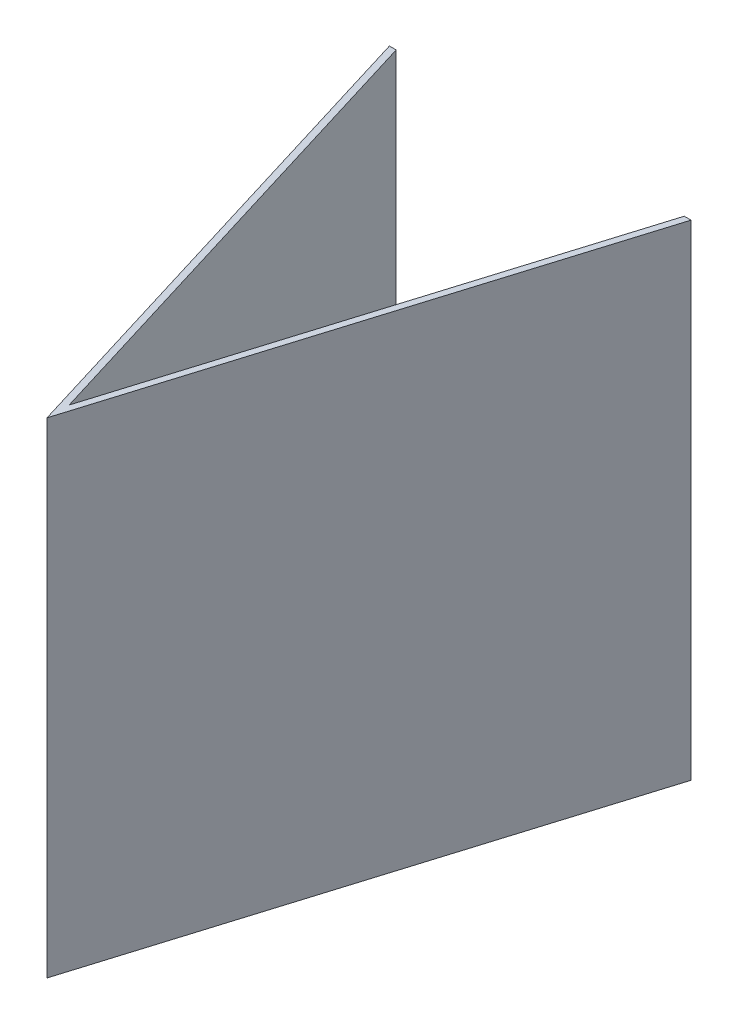
ISO-10303-21;
HEADER;
FILE_DESCRIPTION(('STEP AP214'),'2;1');
FILE_NAME('part.step','',(''),(''),'','','');
FILE_SCHEMA(('AUTOMOTIVE_DESIGN { 1 0 10303 214 1 1 1 1 }'));
ENDSEC;
DATA;
#1=APPLICATION_CONTEXT('core data for automotive mechanical design processes');
#2=APPLICATION_PROTOCOL_DEFINITION('international standard','automotive_design',2000,#1);
#3=PRODUCT_CONTEXT('',#1,'mechanical');
#4=PRODUCT('Part','Part','',(#3));
#5=PRODUCT_RELATED_PRODUCT_CATEGORY('part','',(#4));
#6=PRODUCT_DEFINITION_FORMATION('','',#4);
#7=PRODUCT_DEFINITION_CONTEXT('part definition',#1,'design');
#8=PRODUCT_DEFINITION('design','',#6,#7);
#9=PRODUCT_DEFINITION_SHAPE('','',#8);
#10=(LENGTH_UNIT() NAMED_UNIT(*) SI_UNIT(.MILLI.,.METRE.));
#11=(NAMED_UNIT(*) PLANE_ANGLE_UNIT() SI_UNIT($,.RADIAN.));
#12=(NAMED_UNIT(*) SI_UNIT($,.STERADIAN.) SOLID_ANGLE_UNIT());
#13=UNCERTAINTY_MEASURE_WITH_UNIT(LENGTH_MEASURE(1.E-05),#10,'distance_accuracy_value','');
#14=(GEOMETRIC_REPRESENTATION_CONTEXT(3) GLOBAL_UNCERTAINTY_ASSIGNED_CONTEXT((#13)) GLOBAL_UNIT_ASSIGNED_CONTEXT((#10,
#11,#12)) REPRESENTATION_CONTEXT('',''));
#15=CARTESIAN_POINT('',(0.,0.,0.));
#16=DIRECTION('',(0.,0.,1.));
#17=DIRECTION('',(1.,0.,0.));
#18=AXIS2_PLACEMENT_3D('',#15,#16,#17);
#19=CARTESIAN_POINT('',(-4.47328382881108,-2.51,4.56537000902889));
#20=DIRECTION('',(0.956304755963033,0.,-0.292371704722745));
#21=DIRECTION('',(-0.292371704722745,0.,-0.956304755963033));
#22=AXIS2_PLACEMENT_3D('',#19,#20,#21);
#23=PLANE('',#22);
#24=DIRECTION('',(0.,1.,0.));
#25=VECTOR('',#24,1.);
#26=CARTESIAN_POINT('',(-0.0200292878637927,-2.51,19.1313092850622));
#27=LINE('',#26,#25);
#28=CARTESIAN_POINT('',(-0.0200292878637948,-2.5,19.1313092850622));
#29=VERTEX_POINT('',#28);
#30=CARTESIAN_POINT('',(-0.0200292878637948,12.5,19.1313092850622));
#31=VERTEX_POINT('',#30);
#32=EDGE_CURVE('E11',#29,#31,#27,.T.);
#33=ORIENTED_EDGE('',*,*,#32,.F.);
#34=DIRECTION('',(-0.292371704722745,0.,-0.956304755963033));
#35=VECTOR('',#34,1.);
#36=CARTESIAN_POINT('',(-5.36736335318275,-2.5,1.64096765560485));
#37=LINE('',#36,#35);
#38=CARTESIAN_POINT('',(-4.47328382881108,-2.5,4.56537000902889));
#39=VERTEX_POINT('',#38);
#40=EDGE_CURVE('E107',#29,#39,#37,.T.);
#41=ORIENTED_EDGE('',*,*,#40,.T.);
#42=DIRECTION('',(0.,-1.,0.));
#43=VECTOR('',#42,1.);
#44=CARTESIAN_POINT('',(-4.47328382881108,-2.5,4.56537000902889));
#45=LINE('',#44,#43);
#46=CARTESIAN_POINT('',(-4.47328382881108,12.5,4.56537000902889));
#47=VERTEX_POINT('',#46);
#48=EDGE_CURVE('E103',#47,#39,#45,.T.);
#49=ORIENTED_EDGE('',*,*,#48,.F.);
#50=DIRECTION('',(-0.292371704722745,0.,-0.956304755963033));
#51=VECTOR('',#50,1.);
#52=CARTESIAN_POINT('',(-5.36736335318275,12.5,1.64096765560485));
#53=LINE('',#52,#51);
#54=EDGE_CURVE('E114',#31,#47,#53,.T.);
#55=ORIENTED_EDGE('',*,*,#54,.F.);
#56=EDGE_LOOP('',(#33,#41,#49,#55));
#57=FACE_BOUND('',#56,.T.);
#58=ADVANCED_FACE('F32',(#57),#23,.T.);
#59=CARTESIAN_POINT('',(-0.0200292878637927,-2.51,19.1313092850622));
#60=DIRECTION('',(-0.956304755963036,0.,-0.292371704722737));
#61=DIRECTION('',(-0.292371704722737,0.,0.956304755963036));
#62=AXIS2_PLACEMENT_3D('',#59,#60,#61);
#63=PLANE('',#62);
#64=DIRECTION('',(0.,1.,0.));
#65=VECTOR('',#64,1.);
#66=CARTESIAN_POINT('',(4.43322525308335,-2.5,4.56537000902889));
#67=LINE('',#66,#65);
#68=CARTESIAN_POINT('',(4.43322525308335,-2.5,4.56537000902889));
#69=VERTEX_POINT('',#68);
#70=CARTESIAN_POINT('',(4.43322525308335,12.5,4.56537000902889));
#71=VERTEX_POINT('',#70);
#72=EDGE_CURVE('E91',#69,#71,#67,.T.);
#73=ORIENTED_EDGE('',*,*,#72,.F.);
#74=DIRECTION('',(-0.292371704722737,0.,0.956304755963036));
#75=VECTOR('',#74,1.);
#76=CARTESIAN_POINT('',(5.33072903312821,-2.5,1.62976741996975));
#77=LINE('',#76,#75);
#78=EDGE_CURVE('E100',#69,#29,#77,.T.);
#79=ORIENTED_EDGE('',*,*,#78,.T.);
#80=ORIENTED_EDGE('',*,*,#32,.T.);
#81=DIRECTION('',(-0.292371704722737,0.,0.956304755963036));
#82=VECTOR('',#81,1.);
#83=CARTESIAN_POINT('',(5.33072903312821,12.5,1.62976741996975));
#84=LINE('',#83,#82);
#85=EDGE_CURVE('E102',#71,#31,#84,.T.);
#86=ORIENTED_EDGE('',*,*,#85,.F.);
#87=EDGE_LOOP('',(#73,#79,#80,#86));
#88=FACE_BOUND('',#87,.T.);
#89=ADVANCED_FACE('F99',(#88),#63,.T.);
#90=CARTESIAN_POINT('',(0.,12.5,0.));
#91=DIRECTION('',(0.,1.,0.));
#92=DIRECTION('',(0.,0.,1.));
#93=AXIS2_PLACEMENT_3D('',#90,#91,#92);
#94=PLANE('',#93);
#95=DIRECTION('',(-1.,0.,0.));
#96=VECTOR('',#95,1.);
#97=CARTESIAN_POINT('',(4.64236360438078,12.5,4.56537000902889));
#98=LINE('',#97,#96);
#99=CARTESIAN_POINT('',(4.64236360438078,12.5,4.56537000902889));
#100=VERTEX_POINT('',#99);
#101=EDGE_CURVE('E36',#100,#71,#98,.T.);
#102=ORIENTED_EDGE('',*,*,#101,.T.);
#103=ORIENTED_EDGE('',*,*,#85,.T.);
#104=ORIENTED_EDGE('',*,*,#54,.T.);
#105=CARTESIAN_POINT('',(-4.68242218010851,12.5,4.56537000902889));
#106=VERTEX_POINT('',#105);
#107=EDGE_CURVE('E121',#47,#106,#98,.T.);
#108=ORIENTED_EDGE('',*,*,#107,.T.);
#109=DIRECTION('',(0.292371704722747,0.,0.956304755963032));
#110=VECTOR('',#109,1.);
#111=CARTESIAN_POINT('',(-0.0200292878637907,12.5,19.8153700090289));
#112=LINE('',#111,#110);
#113=CARTESIAN_POINT('',(-0.0200292878637907,12.5,19.8153700090289));
#114=VERTEX_POINT('',#113);
#115=EDGE_CURVE('E41',#106,#114,#112,.T.);
#116=ORIENTED_EDGE('',*,*,#115,.T.);
#117=DIRECTION('',(0.292371704722737,0.,-0.956304755963035));
#118=VECTOR('',#117,1.);
#119=CARTESIAN_POINT('',(0.973595426876858,12.5,16.5653700090289));
#120=LINE('',#119,#118);
#121=EDGE_CURVE('E119',#114,#100,#120,.T.);
#122=ORIENTED_EDGE('',*,*,#121,.T.);
#123=EDGE_LOOP('',(#102,#103,#104,#108,#116,#122));
#124=FACE_BOUND('',#123,.T.);
#125=ADVANCED_FACE('F136',(#124),#94,.T.);
#126=CARTESIAN_POINT('',(4.64236360438078,-2.5,4.56537000902889));
#127=DIRECTION('',(0.,0.,-1.));
#128=DIRECTION('',(-1.,0.,0.));
#129=AXIS2_PLACEMENT_3D('',#126,#127,#128);
#130=PLANE('',#129);
#131=DIRECTION('',(-1.,0.,0.));
#132=VECTOR('',#131,1.);
#133=CARTESIAN_POINT('',(4.64236360438078,-2.5,4.56537000902889));
#134=LINE('',#133,#132);
#135=CARTESIAN_POINT('',(4.64236360438078,-2.5,4.56537000902889));
#136=VERTEX_POINT('',#135);
#137=EDGE_CURVE('E87',#136,#69,#134,.T.);
#138=ORIENTED_EDGE('',*,*,#137,.T.);
#139=ORIENTED_EDGE('',*,*,#72,.T.);
#140=ORIENTED_EDGE('',*,*,#101,.F.);
#141=DIRECTION('',(0.,1.,0.));
#142=VECTOR('',#141,1.);
#143=CARTESIAN_POINT('',(4.64236360438078,-2.5,4.56537000902889));
#144=LINE('',#143,#142);
#145=EDGE_CURVE('E56',#136,#100,#144,.T.);
#146=ORIENTED_EDGE('',*,*,#145,.F.);
#147=EDGE_LOOP('',(#138,#139,#140,#146));
#148=FACE_BOUND('',#147,.T.);
#149=ADVANCED_FACE('F89',(#148),#130,.T.);
#150=CARTESIAN_POINT('',(0.973595426876858,-2.5,16.5653700090289));
#151=DIRECTION('',(0.956304755963036,0.,0.292371704722736));
#152=DIRECTION('',(0.292371704722736,0.,-0.956304755963036));
#153=AXIS2_PLACEMENT_3D('',#150,#151,#152);
#154=PLANE('',#153);
#155=ORIENTED_EDGE('',*,*,#145,.T.);
#156=ORIENTED_EDGE('',*,*,#121,.F.);
#157=DIRECTION('',(0.,1.,0.));
#158=VECTOR('',#157,1.);
#159=CARTESIAN_POINT('',(-0.0200292878637907,-2.5,19.8153700090289));
#160=LINE('',#159,#158);
#161=CARTESIAN_POINT('',(-0.0200292878637907,-2.5,19.8153700090289));
#162=VERTEX_POINT('',#161);
#163=EDGE_CURVE('E49',#162,#114,#160,.T.);
#164=ORIENTED_EDGE('',*,*,#163,.F.);
#165=DIRECTION('',(0.292371704722737,0.,-0.956304755963035));
#166=VECTOR('',#165,1.);
#167=CARTESIAN_POINT('',(0.973595426876858,-2.5,16.5653700090289));
#168=LINE('',#167,#166);
#169=EDGE_CURVE('E124',#162,#136,#168,.T.);
#170=ORIENTED_EDGE('',*,*,#169,.T.);
#171=EDGE_LOOP('',(#155,#156,#164,#170));
#172=FACE_BOUND('',#171,.T.);
#173=ADVANCED_FACE('F153',(#172),#154,.T.);
#174=CARTESIAN_POINT('',(-1.01365400260447,-2.5,16.5653700090289));
#175=DIRECTION('',(-0.956304755963033,0.,0.292371704722745));
#176=DIRECTION('',(0.292371704722745,0.,0.956304755963033));
#177=AXIS2_PLACEMENT_3D('',#174,#175,#176);
#178=PLANE('',#177);
#179=ORIENTED_EDGE('',*,*,#163,.T.);
#180=ORIENTED_EDGE('',*,*,#115,.F.);
#181=DIRECTION('',(0.,1.,0.));
#182=VECTOR('',#181,1.);
#183=CARTESIAN_POINT('',(-4.68242218010851,-2.5,4.56537000902889));
#184=LINE('',#183,#182);
#185=CARTESIAN_POINT('',(-4.68242218010851,-2.5,4.56537000902889));
#186=VERTEX_POINT('',#185);
#187=EDGE_CURVE('E115',#186,#106,#184,.T.);
#188=ORIENTED_EDGE('',*,*,#187,.F.);
#189=DIRECTION('',(0.292371704722747,0.,0.956304755963032));
#190=VECTOR('',#189,1.);
#191=CARTESIAN_POINT('',(-0.0200292878637907,-2.5,19.8153700090289));
#192=LINE('',#191,#190);
#193=EDGE_CURVE('E122',#186,#162,#192,.T.);
#194=ORIENTED_EDGE('',*,*,#193,.T.);
#195=EDGE_LOOP('',(#179,#180,#188,#194));
#196=FACE_BOUND('',#195,.T.);
#197=ADVANCED_FACE('F134',(#196),#178,.T.);
#198=ORIENTED_EDGE('',*,*,#107,.F.);
#199=ORIENTED_EDGE('',*,*,#48,.T.);
#200=EDGE_CURVE('E96',#39,#186,#134,.T.);
#201=ORIENTED_EDGE('',*,*,#200,.T.);
#202=ORIENTED_EDGE('',*,*,#187,.T.);
#203=EDGE_LOOP('',(#198,#199,#201,#202));
#204=FACE_BOUND('',#203,.T.);
#205=ADVANCED_FACE('F132',(#204),#130,.T.);
#206=CARTESIAN_POINT('',(0.,-2.5,0.));
#207=DIRECTION('',(0.,1.,0.));
#208=DIRECTION('',(0.,0.,1.));
#209=AXIS2_PLACEMENT_3D('',#206,#207,#208);
#210=PLANE('',#209);
#211=ORIENTED_EDGE('',*,*,#78,.F.);
#212=ORIENTED_EDGE('',*,*,#137,.F.);
#213=ORIENTED_EDGE('',*,*,#169,.F.);
#214=ORIENTED_EDGE('',*,*,#193,.F.);
#215=ORIENTED_EDGE('',*,*,#200,.F.);
#216=ORIENTED_EDGE('',*,*,#40,.F.);
#217=EDGE_LOOP('',(#211,#212,#213,#214,#215,#216));
#218=FACE_BOUND('',#217,.T.);
#219=ADVANCED_FACE('F34',(#218),#210,.F.);
#220=CLOSED_SHELL('',(#58,#89,#125,#149,#173,#197,#205,#219));
#221=MANIFOLD_SOLID_BREP('B2',#220);
#222=ADVANCED_BREP_SHAPE_REPRESENTATION('',(#18,#221),#14);
#223=SHAPE_DEFINITION_REPRESENTATION(#9,#222);
ENDSEC;
END-ISO-10303-21;
